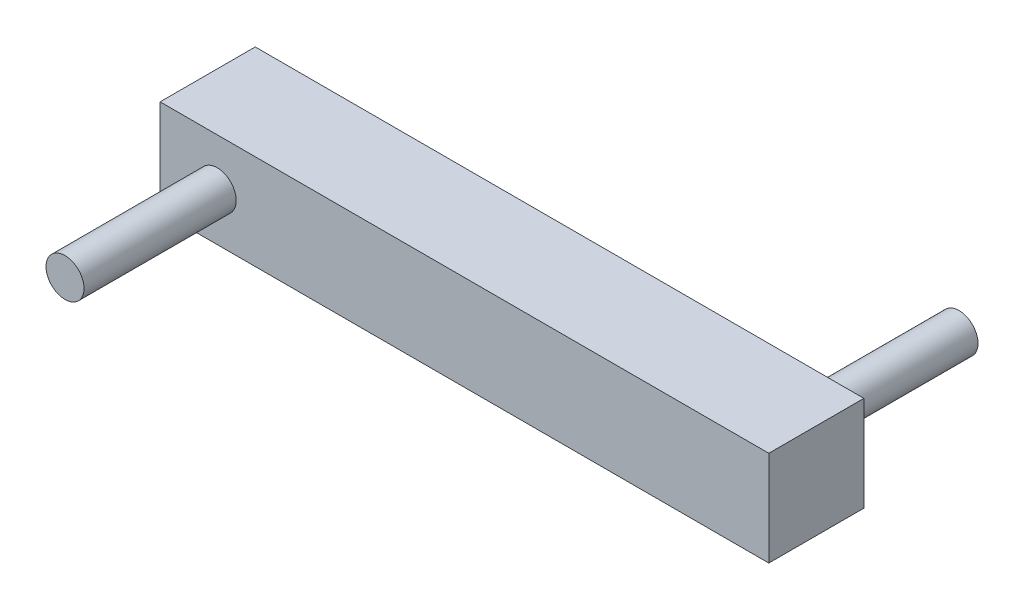
ISO-10303-21;
HEADER;
FILE_DESCRIPTION(('STEP AP214'),'2;1');
FILE_NAME('part.step','',(''),(''),'','','');
FILE_SCHEMA(('AUTOMOTIVE_DESIGN { 1 0 10303 214 1 1 1 1 }'));
ENDSEC;
DATA;
#1=APPLICATION_CONTEXT('core data for automotive mechanical design processes');
#2=APPLICATION_PROTOCOL_DEFINITION('international standard','automotive_design',2000,#1);
#3=PRODUCT_CONTEXT('',#1,'mechanical');
#4=PRODUCT('Part','Part','',(#3));
#5=PRODUCT_RELATED_PRODUCT_CATEGORY('part','',(#4));
#6=PRODUCT_DEFINITION_FORMATION('','',#4);
#7=PRODUCT_DEFINITION_CONTEXT('part definition',#1,'design');
#8=PRODUCT_DEFINITION('design','',#6,#7);
#9=PRODUCT_DEFINITION_SHAPE('','',#8);
#10=(LENGTH_UNIT() NAMED_UNIT(*) SI_UNIT(.MILLI.,.METRE.));
#11=(NAMED_UNIT(*) PLANE_ANGLE_UNIT() SI_UNIT($,.RADIAN.));
#12=(NAMED_UNIT(*) SI_UNIT($,.STERADIAN.) SOLID_ANGLE_UNIT());
#13=UNCERTAINTY_MEASURE_WITH_UNIT(LENGTH_MEASURE(1.E-05),#10,'distance_accuracy_value','');
#14=(GEOMETRIC_REPRESENTATION_CONTEXT(3) GLOBAL_UNCERTAINTY_ASSIGNED_CONTEXT((#13)) GLOBAL_UNIT_ASSIGNED_CONTEXT((#10,
#11,#12)) REPRESENTATION_CONTEXT('',''));
#15=CARTESIAN_POINT('',(0.,0.,0.));
#16=DIRECTION('',(0.,0.,1.));
#17=DIRECTION('',(1.,0.,0.));
#18=AXIS2_PLACEMENT_3D('',#15,#16,#17);
#19=CARTESIAN_POINT('',(0.,0.,1.25));
#20=DIRECTION('',(1.,0.,0.));
#21=DIRECTION('',(0.,0.,-1.));
#22=AXIS2_PLACEMENT_3D('',#19,#20,#21);
#23=PLANE('',#22);
#24=DIRECTION('',(0.,-1.,0.));
#25=VECTOR('',#24,1.);
#26=CARTESIAN_POINT('',(0.,0.,-1.25));
#27=LINE('',#26,#25);
#28=CARTESIAN_POINT('',(0.,2.5,-1.25));
#29=VERTEX_POINT('',#28);
#30=CARTESIAN_POINT('',(0.,0.,-1.25));
#31=VERTEX_POINT('',#30);
#32=EDGE_CURVE('E116',#29,#31,#27,.T.);
#33=ORIENTED_EDGE('',*,*,#32,.T.);
#34=DIRECTION('',(0.,0.,-1.));
#35=VECTOR('',#34,1.);
#36=CARTESIAN_POINT('',(0.,0.,1.25));
#37=LINE('',#36,#35);
#38=CARTESIAN_POINT('',(0.,0.,1.25));
#39=VERTEX_POINT('',#38);
#40=EDGE_CURVE('E54',#39,#31,#37,.T.);
#41=ORIENTED_EDGE('',*,*,#40,.F.);
#42=DIRECTION('',(0.,-1.,0.));
#43=VECTOR('',#42,1.);
#44=CARTESIAN_POINT('',(0.,0.,1.25));
#45=LINE('',#44,#43);
#46=CARTESIAN_POINT('',(0.,2.5,1.25));
#47=VERTEX_POINT('',#46);
#48=EDGE_CURVE('E98',#47,#39,#45,.T.);
#49=ORIENTED_EDGE('',*,*,#48,.F.);
#50=DIRECTION('',(0.,0.,-1.));
#51=VECTOR('',#50,1.);
#52=CARTESIAN_POINT('',(0.,2.5,1.25));
#53=LINE('',#52,#51);
#54=EDGE_CURVE('E112',#47,#29,#53,.T.);
#55=ORIENTED_EDGE('',*,*,#54,.T.);
#56=EDGE_LOOP('',(#33,#41,#49,#55));
#57=FACE_BOUND('',#56,.T.);
#58=ADVANCED_FACE('F45',(#57),#23,.F.);
#59=CARTESIAN_POINT('',(0.,0.,1.25));
#60=DIRECTION('',(0.,1.,0.));
#61=DIRECTION('',(0.,0.,1.));
#62=AXIS2_PLACEMENT_3D('',#59,#60,#61);
#63=PLANE('',#62);
#64=DIRECTION('',(1.,0.,0.));
#65=VECTOR('',#64,1.);
#66=CARTESIAN_POINT('',(0.,0.,-1.25));
#67=LINE('',#66,#65);
#68=CARTESIAN_POINT('',(16.,0.,-1.25));
#69=VERTEX_POINT('',#68);
#70=EDGE_CURVE('E104',#31,#69,#67,.T.);
#71=ORIENTED_EDGE('',*,*,#70,.T.);
#72=DIRECTION('',(0.,0.,-1.));
#73=VECTOR('',#72,1.);
#74=CARTESIAN_POINT('',(16.,0.,1.25));
#75=LINE('',#74,#73);
#76=CARTESIAN_POINT('',(16.,0.,1.25));
#77=VERTEX_POINT('',#76);
#78=EDGE_CURVE('E102',#77,#69,#75,.T.);
#79=ORIENTED_EDGE('',*,*,#78,.F.);
#80=DIRECTION('',(1.,0.,0.));
#81=VECTOR('',#80,1.);
#82=CARTESIAN_POINT('',(0.,0.,1.25));
#83=LINE('',#82,#81);
#84=EDGE_CURVE('E93',#39,#77,#83,.T.);
#85=ORIENTED_EDGE('',*,*,#84,.F.);
#86=ORIENTED_EDGE('',*,*,#40,.T.);
#87=EDGE_LOOP('',(#71,#79,#85,#86));
#88=FACE_BOUND('',#87,.T.);
#89=ADVANCED_FACE('F103',(#88),#63,.F.);
#90=CARTESIAN_POINT('',(16.,0.,1.25));
#91=DIRECTION('',(-1.,0.,0.));
#92=DIRECTION('',(0.,0.,1.));
#93=AXIS2_PLACEMENT_3D('',#90,#91,#92);
#94=PLANE('',#93);
#95=DIRECTION('',(0.,1.,0.));
#96=VECTOR('',#95,1.);
#97=CARTESIAN_POINT('',(16.,0.,-1.25));
#98=LINE('',#97,#96);
#99=CARTESIAN_POINT('',(16.,2.5,-1.25));
#100=VERTEX_POINT('',#99);
#101=EDGE_CURVE('E79',#69,#100,#98,.T.);
#102=ORIENTED_EDGE('',*,*,#101,.T.);
#103=DIRECTION('',(0.,0.,-1.));
#104=VECTOR('',#103,1.);
#105=CARTESIAN_POINT('',(16.,2.5,1.25));
#106=LINE('',#105,#104);
#107=CARTESIAN_POINT('',(16.,2.5,1.25));
#108=VERTEX_POINT('',#107);
#109=EDGE_CURVE('E106',#108,#100,#106,.T.);
#110=ORIENTED_EDGE('',*,*,#109,.F.);
#111=DIRECTION('',(0.,1.,0.));
#112=VECTOR('',#111,1.);
#113=CARTESIAN_POINT('',(16.,0.,1.25));
#114=LINE('',#113,#112);
#115=EDGE_CURVE('E96',#77,#108,#114,.T.);
#116=ORIENTED_EDGE('',*,*,#115,.F.);
#117=ORIENTED_EDGE('',*,*,#78,.T.);
#118=EDGE_LOOP('',(#102,#110,#116,#117));
#119=FACE_BOUND('',#118,.T.);
#120=ADVANCED_FACE('F108',(#119),#94,.F.);
#121=CARTESIAN_POINT('',(0.,2.5,1.25));
#122=DIRECTION('',(0.,-1.,0.));
#123=DIRECTION('',(0.,0.,-1.));
#124=AXIS2_PLACEMENT_3D('',#121,#122,#123);
#125=PLANE('',#124);
#126=DIRECTION('',(-1.,0.,0.));
#127=VECTOR('',#126,1.);
#128=CARTESIAN_POINT('',(0.,2.5,-1.25));
#129=LINE('',#128,#127);
#130=EDGE_CURVE('E85',#100,#29,#129,.T.);
#131=ORIENTED_EDGE('',*,*,#130,.T.);
#132=ORIENTED_EDGE('',*,*,#54,.F.);
#133=DIRECTION('',(-1.,0.,0.));
#134=VECTOR('',#133,1.);
#135=CARTESIAN_POINT('',(0.,2.5,1.25));
#136=LINE('',#135,#134);
#137=EDGE_CURVE('E62',#108,#47,#136,.T.);
#138=ORIENTED_EDGE('',*,*,#137,.F.);
#139=ORIENTED_EDGE('',*,*,#109,.T.);
#140=EDGE_LOOP('',(#131,#132,#138,#139));
#141=FACE_BOUND('',#140,.T.);
#142=ADVANCED_FACE('F148',(#141),#125,.F.);
#143=CARTESIAN_POINT('',(0.,0.,1.25));
#144=DIRECTION('',(0.,0.,-1.));
#145=DIRECTION('',(-1.,0.,0.));
#146=AXIS2_PLACEMENT_3D('',#143,#144,#145);
#147=PLANE('',#146);
#148=CARTESIAN_POINT('',(1.5,1.25,1.25));
#149=DIRECTION('',(0.,0.,-1.));
#150=DIRECTION('',(-1.,0.,0.));
#151=AXIS2_PLACEMENT_3D('',#148,#149,#150);
#152=CIRCLE('',#151,0.5);
#153=CARTESIAN_POINT('',(1.,1.25,1.25));
#154=VERTEX_POINT('',#153);
#155=EDGE_CURVE('E11',#154,#154,#152,.F.);
#156=ORIENTED_EDGE('',*,*,#155,.F.);
#157=EDGE_LOOP('',(#156));
#158=FACE_BOUND('',#157,.T.);
#159=ORIENTED_EDGE('',*,*,#48,.T.);
#160=ORIENTED_EDGE('',*,*,#84,.T.);
#161=ORIENTED_EDGE('',*,*,#115,.T.);
#162=ORIENTED_EDGE('',*,*,#137,.T.);
#163=EDGE_LOOP('',(#159,#160,#161,#162));
#164=FACE_BOUND('',#163,.T.);
#165=ADVANCED_FACE('F94',(#158,#164),#147,.F.);
#166=CARTESIAN_POINT('',(0.,0.,-1.25));
#167=DIRECTION('',(0.,0.,-1.));
#168=DIRECTION('',(-1.,0.,0.));
#169=AXIS2_PLACEMENT_3D('',#166,#167,#168);
#170=PLANE('',#169);
#171=CARTESIAN_POINT('',(14.5,1.25,-1.25));
#172=DIRECTION('',(0.,0.,-1.));
#173=DIRECTION('',(-1.,0.,0.));
#174=AXIS2_PLACEMENT_3D('',#171,#172,#173);
#175=CIRCLE('',#174,0.500000000000001);
#176=CARTESIAN_POINT('',(14.,1.25,-1.25));
#177=VERTEX_POINT('',#176);
#178=EDGE_CURVE('E210',#177,#177,#175,.T.);
#179=ORIENTED_EDGE('',*,*,#178,.F.);
#180=EDGE_LOOP('',(#179));
#181=FACE_BOUND('',#180,.T.);
#182=ORIENTED_EDGE('',*,*,#32,.F.);
#183=ORIENTED_EDGE('',*,*,#130,.F.);
#184=ORIENTED_EDGE('',*,*,#101,.F.);
#185=ORIENTED_EDGE('',*,*,#70,.F.);
#186=EDGE_LOOP('',(#182,#183,#184,#185));
#187=FACE_BOUND('',#186,.T.);
#188=ADVANCED_FACE('F134',(#181,#187),#170,.T.);
#189=CARTESIAN_POINT('',(1.5,1.25,5.25));
#190=DIRECTION('',(0.,0.,-1.));
#191=DIRECTION('',(-1.,0.,0.));
#192=AXIS2_PLACEMENT_3D('',#189,#190,#191);
#193=CYLINDRICAL_SURFACE('',#192,0.5);
#194=CARTESIAN_POINT('',(1.5,1.25,5.25));
#195=DIRECTION('',(0.,0.,1.));
#196=DIRECTION('',(1.,0.,0.));
#197=AXIS2_PLACEMENT_3D('',#194,#195,#196);
#198=CIRCLE('',#197,0.5);
#199=CARTESIAN_POINT('',(2.,1.25,5.25));
#200=VERTEX_POINT('',#199);
#201=EDGE_CURVE('E120',#200,#200,#198,.T.);
#202=ORIENTED_EDGE('',*,*,#201,.F.);
#203=EDGE_LOOP('',(#202));
#204=FACE_BOUND('',#203,.T.);
#205=ORIENTED_EDGE('',*,*,#155,.T.);
#206=EDGE_LOOP('',(#205));
#207=FACE_BOUND('',#206,.T.);
#208=ADVANCED_FACE('F136',(#204,#207),#193,.T.);
#209=CARTESIAN_POINT('',(1.5,1.25,5.25));
#210=DIRECTION('',(0.,0.,1.));
#211=DIRECTION('',(1.,0.,0.));
#212=AXIS2_PLACEMENT_3D('',#209,#210,#211);
#213=PLANE('',#212);
#214=ORIENTED_EDGE('',*,*,#201,.T.);
#215=EDGE_LOOP('',(#214));
#216=FACE_BOUND('',#215,.T.);
#217=ADVANCED_FACE('F144',(#216),#213,.T.);
#218=CARTESIAN_POINT('',(14.5,1.25,-5.25));
#219=DIRECTION('',(0.,0.,1.));
#220=DIRECTION('',(1.,0.,0.));
#221=AXIS2_PLACEMENT_3D('',#218,#219,#220);
#222=CYLINDRICAL_SURFACE('',#221,0.500000000000001);
#223=CARTESIAN_POINT('',(14.5,1.25,-5.25));
#224=DIRECTION('',(0.,0.,-1.));
#225=DIRECTION('',(-1.,0.,0.));
#226=AXIS2_PLACEMENT_3D('',#223,#224,#225);
#227=CIRCLE('',#226,0.500000000000001);
#228=CARTESIAN_POINT('',(14.,1.25,-5.25));
#229=VERTEX_POINT('',#228);
#230=EDGE_CURVE('E208',#229,#229,#227,.T.);
#231=ORIENTED_EDGE('',*,*,#230,.F.);
#232=EDGE_LOOP('',(#231));
#233=FACE_BOUND('',#232,.T.);
#234=ORIENTED_EDGE('',*,*,#178,.T.);
#235=EDGE_LOOP('',(#234));
#236=FACE_BOUND('',#235,.T.);
#237=ADVANCED_FACE('F181',(#233,#236),#222,.T.);
#238=CARTESIAN_POINT('',(14.5,1.25,-5.25));
#239=DIRECTION('',(0.,0.,-1.));
#240=DIRECTION('',(-1.,0.,0.));
#241=AXIS2_PLACEMENT_3D('',#238,#239,#240);
#242=PLANE('',#241);
#243=ORIENTED_EDGE('',*,*,#230,.T.);
#244=EDGE_LOOP('',(#243));
#245=FACE_BOUND('',#244,.T.);
#246=ADVANCED_FACE('F193',(#245),#242,.T.);
#247=CLOSED_SHELL('',(#58,#89,#120,#142,#165,#188,#208,#217,#237,#246));
#248=MANIFOLD_SOLID_BREP('B2',#247);
#249=ADVANCED_BREP_SHAPE_REPRESENTATION('',(#18,#248),#14);
#250=SHAPE_DEFINITION_REPRESENTATION(#9,#249);
ENDSEC;
END-ISO-10303-21;
